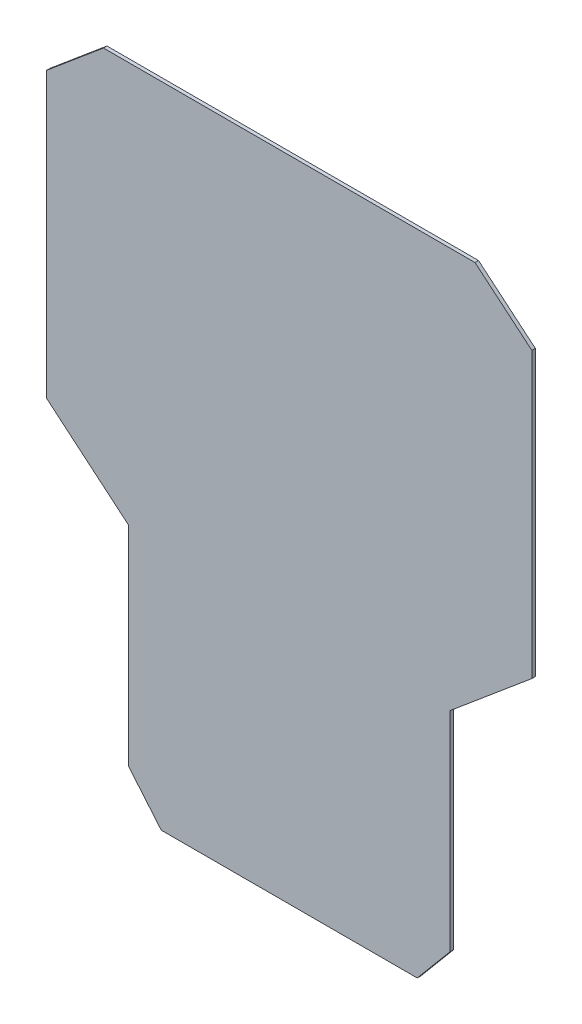
ISO-10303-21;
HEADER;
FILE_DESCRIPTION(('STEP AP214'),'2;1');
FILE_NAME('part.step','',(''),(''),'','','');
FILE_SCHEMA(('AUTOMOTIVE_DESIGN { 1 0 10303 214 1 1 1 1 }'));
ENDSEC;
DATA;
#1=APPLICATION_CONTEXT('core data for automotive mechanical design processes');
#2=APPLICATION_PROTOCOL_DEFINITION('international standard','automotive_design',2000,#1);
#3=PRODUCT_CONTEXT('',#1,'mechanical');
#4=PRODUCT('Part','Part','',(#3));
#5=PRODUCT_RELATED_PRODUCT_CATEGORY('part','',(#4));
#6=PRODUCT_DEFINITION_FORMATION('','',#4);
#7=PRODUCT_DEFINITION_CONTEXT('part definition',#1,'design');
#8=PRODUCT_DEFINITION('design','',#6,#7);
#9=PRODUCT_DEFINITION_SHAPE('','',#8);
#10=(LENGTH_UNIT() NAMED_UNIT(*) SI_UNIT(.MILLI.,.METRE.));
#11=(NAMED_UNIT(*) PLANE_ANGLE_UNIT() SI_UNIT($,.RADIAN.));
#12=(NAMED_UNIT(*) SI_UNIT($,.STERADIAN.) SOLID_ANGLE_UNIT());
#13=UNCERTAINTY_MEASURE_WITH_UNIT(LENGTH_MEASURE(1.E-05),#10,'distance_accuracy_value','');
#14=(GEOMETRIC_REPRESENTATION_CONTEXT(3) GLOBAL_UNCERTAINTY_ASSIGNED_CONTEXT((#13)) GLOBAL_UNIT_ASSIGNED_CONTEXT((#10,
#11,#12)) REPRESENTATION_CONTEXT('',''));
#15=CARTESIAN_POINT('',(0.,0.,0.));
#16=DIRECTION('',(0.,0.,1.));
#17=DIRECTION('',(1.,0.,0.));
#18=AXIS2_PLACEMENT_3D('',#15,#16,#17);
#19=CARTESIAN_POINT('',(69.,-50.8930332304934,1.5));
#20=DIRECTION('',(-1.,0.,0.));
#21=DIRECTION('',(0.,-1.,0.));
#22=AXIS2_PLACEMENT_3D('',#19,#20,#21);
#23=PLANE('',#22);
#24=DIRECTION('',(0.,1.,0.));
#25=VECTOR('',#24,1.);
#26=CARTESIAN_POINT('',(69.,-50.8930332304934,0.));
#27=LINE('',#26,#25);
#28=CARTESIAN_POINT('',(69.,-140.409741205043,0.));
#29=VERTEX_POINT('',#28);
#30=CARTESIAN_POINT('',(69.,-50.8930332304934,0.));
#31=VERTEX_POINT('',#30);
#32=EDGE_CURVE('E153',#29,#31,#27,.T.);
#33=ORIENTED_EDGE('',*,*,#32,.T.);
#34=DIRECTION('',(0.,0.,-1.));
#35=VECTOR('',#34,1.);
#36=CARTESIAN_POINT('',(69.,-50.8930332304934,1.5));
#37=LINE('',#36,#35);
#38=CARTESIAN_POINT('',(69.,-50.8930332304934,1.5));
#39=VERTEX_POINT('',#38);
#40=EDGE_CURVE('E11',#39,#31,#37,.T.);
#41=ORIENTED_EDGE('',*,*,#40,.F.);
#42=DIRECTION('',(0.,1.,0.));
#43=VECTOR('',#42,1.);
#44=CARTESIAN_POINT('',(69.,-50.8930332304934,1.5));
#45=LINE('',#44,#43);
#46=CARTESIAN_POINT('',(69.,-140.409741205043,1.5));
#47=VERTEX_POINT('',#46);
#48=EDGE_CURVE('E175',#47,#39,#45,.T.);
#49=ORIENTED_EDGE('',*,*,#48,.F.);
#50=DIRECTION('',(0.,0.,-1.));
#51=VECTOR('',#50,1.);
#52=CARTESIAN_POINT('',(69.,-140.409741205043,1.5));
#53=LINE('',#52,#51);
#54=EDGE_CURVE('E149',#47,#29,#53,.T.);
#55=ORIENTED_EDGE('',*,*,#54,.T.);
#56=EDGE_LOOP('',(#33,#41,#49,#55));
#57=FACE_BOUND('',#56,.T.);
#58=ADVANCED_FACE('F33',(#57),#23,.F.);
#59=CARTESIAN_POINT('',(104.,-21.5245461392886,1.5));
#60=DIRECTION('',(-0.642787609686538,0.766044443118979,0.));
#61=DIRECTION('',(-0.766044443118979,-0.642787609686538,0.));
#62=AXIS2_PLACEMENT_3D('',#59,#60,#61);
#63=PLANE('',#62);
#64=DIRECTION('',(0.766044443118979,0.642787609686538,0.));
#65=VECTOR('',#64,1.);
#66=CARTESIAN_POINT('',(104.,-21.5245461392886,0.));
#67=LINE('',#66,#65);
#68=CARTESIAN_POINT('',(104.,-21.5245461392886,0.));
#69=VERTEX_POINT('',#68);
#70=EDGE_CURVE('E156',#31,#69,#67,.T.);
#71=ORIENTED_EDGE('',*,*,#70,.T.);
#72=DIRECTION('',(0.,0.,-1.));
#73=VECTOR('',#72,1.);
#74=CARTESIAN_POINT('',(104.,-21.5245461392886,1.5));
#75=LINE('',#74,#73);
#76=CARTESIAN_POINT('',(104.,-21.5245461392886,1.5));
#77=VERTEX_POINT('',#76);
#78=EDGE_CURVE('E41',#77,#69,#75,.T.);
#79=ORIENTED_EDGE('',*,*,#78,.F.);
#80=DIRECTION('',(0.766044443118979,0.642787609686538,0.));
#81=VECTOR('',#80,1.);
#82=CARTESIAN_POINT('',(104.,-21.5245461392886,1.5));
#83=LINE('',#82,#81);
#84=EDGE_CURVE('E104',#39,#77,#83,.T.);
#85=ORIENTED_EDGE('',*,*,#84,.F.);
#86=ORIENTED_EDGE('',*,*,#40,.T.);
#87=EDGE_LOOP('',(#71,#79,#85,#86));
#88=FACE_BOUND('',#87,.T.);
#89=ADVANCED_FACE('F253',(#88),#63,.F.);
#90=CARTESIAN_POINT('',(104.,100.307715928557,1.5));
#91=DIRECTION('',(-1.,0.,0.));
#92=DIRECTION('',(0.,-1.,0.));
#93=AXIS2_PLACEMENT_3D('',#90,#91,#92);
#94=PLANE('',#93);
#95=DIRECTION('',(0.,1.,0.));
#96=VECTOR('',#95,1.);
#97=CARTESIAN_POINT('',(104.,100.307715928557,0.));
#98=LINE('',#97,#96);
#99=CARTESIAN_POINT('',(104.,100.307715928557,0.));
#100=VERTEX_POINT('',#99);
#101=EDGE_CURVE('E158',#69,#100,#98,.T.);
#102=ORIENTED_EDGE('',*,*,#101,.T.);
#103=DIRECTION('',(0.,0.,-1.));
#104=VECTOR('',#103,1.);
#105=CARTESIAN_POINT('',(104.,100.307715928557,1.5));
#106=LINE('',#105,#104);
#107=CARTESIAN_POINT('',(104.,100.307715928557,1.5));
#108=VERTEX_POINT('',#107);
#109=EDGE_CURVE('E194',#108,#100,#106,.T.);
#110=ORIENTED_EDGE('',*,*,#109,.F.);
#111=DIRECTION('',(0.,1.,0.));
#112=VECTOR('',#111,1.);
#113=CARTESIAN_POINT('',(104.,100.307715928557,1.5));
#114=LINE('',#113,#112);
#115=EDGE_CURVE('E202',#77,#108,#114,.T.);
#116=ORIENTED_EDGE('',*,*,#115,.F.);
#117=ORIENTED_EDGE('',*,*,#78,.T.);
#118=EDGE_LOOP('',(#102,#110,#116,#117));
#119=FACE_BOUND('',#118,.T.);
#120=ADVANCED_FACE('F200',(#119),#94,.F.);
#121=CARTESIAN_POINT('',(79.6360297657338,120.751514366145,1.5));
#122=DIRECTION('',(-0.642787609686543,-0.766044443118975,0.));
#123=DIRECTION('',(0.766044443118975,-0.642787609686543,0.));
#124=AXIS2_PLACEMENT_3D('',#121,#122,#123);
#125=PLANE('',#124);
#126=DIRECTION('',(-0.766044443118975,0.642787609686543,0.));
#127=VECTOR('',#126,1.);
#128=CARTESIAN_POINT('',(79.6360297657338,120.751514366145,0.));
#129=LINE('',#128,#127);
#130=CARTESIAN_POINT('',(79.6360297657338,120.751514366145,0.));
#131=VERTEX_POINT('',#130);
#132=EDGE_CURVE('E160',#100,#131,#129,.T.);
#133=ORIENTED_EDGE('',*,*,#132,.T.);
#134=DIRECTION('',(0.,0.,-1.));
#135=VECTOR('',#134,1.);
#136=CARTESIAN_POINT('',(79.6360297657338,120.751514366145,1.5));
#137=LINE('',#136,#135);
#138=CARTESIAN_POINT('',(79.6360297657338,120.751514366145,1.5));
#139=VERTEX_POINT('',#138);
#140=EDGE_CURVE('E191',#139,#131,#137,.T.);
#141=ORIENTED_EDGE('',*,*,#140,.F.);
#142=DIRECTION('',(-0.766044443118975,0.642787609686543,0.));
#143=VECTOR('',#142,1.);
#144=CARTESIAN_POINT('',(79.6360297657338,120.751514366145,1.5));
#145=LINE('',#144,#143);
#146=EDGE_CURVE('E220',#108,#139,#145,.T.);
#147=ORIENTED_EDGE('',*,*,#146,.F.);
#148=ORIENTED_EDGE('',*,*,#109,.T.);
#149=EDGE_LOOP('',(#133,#141,#147,#148));
#150=FACE_BOUND('',#149,.T.);
#151=ADVANCED_FACE('F211',(#150),#125,.F.);
#152=CARTESIAN_POINT('',(-79.6360297657337,120.751514366145,1.5));
#153=DIRECTION('',(0.,-1.,0.));
#154=DIRECTION('',(0.,0.,-1.));
#155=AXIS2_PLACEMENT_3D('',#152,#153,#154);
#156=PLANE('',#155);
#157=DIRECTION('',(-1.,0.,0.));
#158=VECTOR('',#157,1.);
#159=CARTESIAN_POINT('',(-79.6360297657337,120.751514366145,0.));
#160=LINE('',#159,#158);
#161=CARTESIAN_POINT('',(-79.6360297657337,120.751514366145,0.));
#162=VERTEX_POINT('',#161);
#163=EDGE_CURVE('E162',#131,#162,#160,.T.);
#164=ORIENTED_EDGE('',*,*,#163,.T.);
#165=DIRECTION('',(0.,0.,-1.));
#166=VECTOR('',#165,1.);
#167=CARTESIAN_POINT('',(-79.6360297657337,120.751514366145,1.5));
#168=LINE('',#167,#166);
#169=CARTESIAN_POINT('',(-79.6360297657337,120.751514366145,1.5));
#170=VERTEX_POINT('',#169);
#171=EDGE_CURVE('E188',#170,#162,#168,.T.);
#172=ORIENTED_EDGE('',*,*,#171,.F.);
#173=DIRECTION('',(-1.,0.,0.));
#174=VECTOR('',#173,1.);
#175=CARTESIAN_POINT('',(-79.6360297657337,120.751514366145,1.5));
#176=LINE('',#175,#174);
#177=EDGE_CURVE('E217',#139,#170,#176,.T.);
#178=ORIENTED_EDGE('',*,*,#177,.F.);
#179=ORIENTED_EDGE('',*,*,#140,.T.);
#180=EDGE_LOOP('',(#164,#172,#178,#179));
#181=FACE_BOUND('',#180,.T.);
#182=ADVANCED_FACE('F215',(#181),#156,.F.);
#183=CARTESIAN_POINT('',(-104.,100.307715928557,1.5));
#184=DIRECTION('',(0.642787609686542,-0.766044443118976,0.));
#185=DIRECTION('',(0.766044443118976,0.642787609686542,0.));
#186=AXIS2_PLACEMENT_3D('',#183,#184,#185);
#187=PLANE('',#186);
#188=DIRECTION('',(-0.766044443118976,-0.642787609686542,0.));
#189=VECTOR('',#188,1.);
#190=CARTESIAN_POINT('',(-104.,100.307715928557,0.));
#191=LINE('',#190,#189);
#192=CARTESIAN_POINT('',(-104.,100.307715928557,0.));
#193=VERTEX_POINT('',#192);
#194=EDGE_CURVE('E164',#162,#193,#191,.T.);
#195=ORIENTED_EDGE('',*,*,#194,.T.);
#196=DIRECTION('',(0.,0.,-1.));
#197=VECTOR('',#196,1.);
#198=CARTESIAN_POINT('',(-104.,100.307715928557,1.5));
#199=LINE('',#198,#197);
#200=CARTESIAN_POINT('',(-104.,100.307715928557,1.5));
#201=VERTEX_POINT('',#200);
#202=EDGE_CURVE('E185',#201,#193,#199,.T.);
#203=ORIENTED_EDGE('',*,*,#202,.F.);
#204=DIRECTION('',(-0.766044443118976,-0.642787609686542,0.));
#205=VECTOR('',#204,1.);
#206=CARTESIAN_POINT('',(-104.,100.307715928557,1.5));
#207=LINE('',#206,#205);
#208=EDGE_CURVE('E219',#170,#201,#207,.T.);
#209=ORIENTED_EDGE('',*,*,#208,.F.);
#210=ORIENTED_EDGE('',*,*,#171,.T.);
#211=EDGE_LOOP('',(#195,#203,#209,#210));
#212=FACE_BOUND('',#211,.T.);
#213=ADVANCED_FACE('F266',(#212),#187,.F.);
#214=CARTESIAN_POINT('',(-104.,100.307715928557,1.5));
#215=DIRECTION('',(1.,0.,0.));
#216=DIRECTION('',(0.,1.,0.));
#217=AXIS2_PLACEMENT_3D('',#214,#215,#216);
#218=PLANE('',#217);
#219=DIRECTION('',(0.,-1.,0.));
#220=VECTOR('',#219,1.);
#221=CARTESIAN_POINT('',(-104.,100.307715928557,0.));
#222=LINE('',#221,#220);
#223=CARTESIAN_POINT('',(-104.,-21.5245461392886,0.));
#224=VERTEX_POINT('',#223);
#225=EDGE_CURVE('E166',#193,#224,#222,.T.);
#226=ORIENTED_EDGE('',*,*,#225,.T.);
#227=DIRECTION('',(0.,0.,-1.));
#228=VECTOR('',#227,1.);
#229=CARTESIAN_POINT('',(-104.,-21.5245461392886,1.5));
#230=LINE('',#229,#228);
#231=CARTESIAN_POINT('',(-104.,-21.5245461392886,1.5));
#232=VERTEX_POINT('',#231);
#233=EDGE_CURVE('E182',#232,#224,#230,.T.);
#234=ORIENTED_EDGE('',*,*,#233,.F.);
#235=DIRECTION('',(0.,-1.,0.));
#236=VECTOR('',#235,1.);
#237=CARTESIAN_POINT('',(-104.,100.307715928557,1.5));
#238=LINE('',#237,#236);
#239=EDGE_CURVE('E222',#201,#232,#238,.T.);
#240=ORIENTED_EDGE('',*,*,#239,.F.);
#241=ORIENTED_EDGE('',*,*,#202,.T.);
#242=EDGE_LOOP('',(#226,#234,#240,#241));
#243=FACE_BOUND('',#242,.T.);
#244=ADVANCED_FACE('F269',(#243),#218,.F.);
#245=CARTESIAN_POINT('',(-104.,-21.5245461392886,1.5));
#246=DIRECTION('',(0.642787609686538,0.766044443118979,0.));
#247=DIRECTION('',(-0.766044443118979,0.642787609686538,0.));
#248=AXIS2_PLACEMENT_3D('',#245,#246,#247);
#249=PLANE('',#248);
#250=DIRECTION('',(0.766044443118979,-0.642787609686538,0.));
#251=VECTOR('',#250,1.);
#252=CARTESIAN_POINT('',(-104.,-21.5245461392886,0.));
#253=LINE('',#252,#251);
#254=CARTESIAN_POINT('',(-69.,-50.8930332304934,0.));
#255=VERTEX_POINT('',#254);
#256=EDGE_CURVE('E168',#224,#255,#253,.T.);
#257=ORIENTED_EDGE('',*,*,#256,.T.);
#258=DIRECTION('',(0.,0.,-1.));
#259=VECTOR('',#258,1.);
#260=CARTESIAN_POINT('',(-69.,-50.8930332304934,1.5));
#261=LINE('',#260,#259);
#262=CARTESIAN_POINT('',(-69.,-50.8930332304934,1.5));
#263=VERTEX_POINT('',#262);
#264=EDGE_CURVE('E179',#263,#255,#261,.T.);
#265=ORIENTED_EDGE('',*,*,#264,.F.);
#266=DIRECTION('',(0.766044443118979,-0.642787609686538,0.));
#267=VECTOR('',#266,1.);
#268=CARTESIAN_POINT('',(-104.,-21.5245461392886,1.5));
#269=LINE('',#268,#267);
#270=EDGE_CURVE('E228',#232,#263,#269,.T.);
#271=ORIENTED_EDGE('',*,*,#270,.F.);
#272=ORIENTED_EDGE('',*,*,#233,.T.);
#273=EDGE_LOOP('',(#257,#265,#271,#272));
#274=FACE_BOUND('',#273,.T.);
#275=ADVANCED_FACE('F234',(#274),#249,.F.);
#276=CARTESIAN_POINT('',(-69.,-50.8930332304934,1.5));
#277=DIRECTION('',(1.,0.,0.));
#278=DIRECTION('',(0.,1.,0.));
#279=AXIS2_PLACEMENT_3D('',#276,#277,#278);
#280=PLANE('',#279);
#281=DIRECTION('',(0.,-1.,0.));
#282=VECTOR('',#281,1.);
#283=CARTESIAN_POINT('',(-69.,-50.8930332304934,0.));
#284=LINE('',#283,#282);
#285=CARTESIAN_POINT('',(-69.,-140.409741205043,0.));
#286=VERTEX_POINT('',#285);
#287=EDGE_CURVE('E170',#255,#286,#284,.T.);
#288=ORIENTED_EDGE('',*,*,#287,.T.);
#289=DIRECTION('',(0.,0.,-1.));
#290=VECTOR('',#289,1.);
#291=CARTESIAN_POINT('',(-69.,-140.409741205043,1.5));
#292=LINE('',#291,#290);
#293=CARTESIAN_POINT('',(-69.,-140.409741205043,1.5));
#294=VERTEX_POINT('',#293);
#295=EDGE_CURVE('E144',#294,#286,#292,.T.);
#296=ORIENTED_EDGE('',*,*,#295,.F.);
#297=DIRECTION('',(0.,-1.,0.));
#298=VECTOR('',#297,1.);
#299=CARTESIAN_POINT('',(-69.,-50.8930332304934,1.5));
#300=LINE('',#299,#298);
#301=EDGE_CURVE('E135',#263,#294,#300,.T.);
#302=ORIENTED_EDGE('',*,*,#301,.F.);
#303=ORIENTED_EDGE('',*,*,#264,.T.);
#304=EDGE_LOOP('',(#288,#296,#302,#303));
#305=FACE_BOUND('',#304,.T.);
#306=ADVANCED_FACE('F238',(#305),#280,.F.);
#307=CARTESIAN_POINT('',(-69.,-140.409741205043,1.5));
#308=DIRECTION('',(0.766044443118979,0.642787609686539,0.));
#309=DIRECTION('',(-0.642787609686539,0.766044443118979,0.));
#310=AXIS2_PLACEMENT_3D('',#307,#308,#309);
#311=PLANE('',#310);
#312=DIRECTION('',(0.642787609686539,-0.766044443118979,0.));
#313=VECTOR('',#312,1.);
#314=CARTESIAN_POINT('',(-69.,-140.409741205043,0.));
#315=LINE('',#314,#313);
#316=CARTESIAN_POINT('',(-54.8706157602949,-157.248485633855,0.));
#317=VERTEX_POINT('',#316);
#318=EDGE_CURVE('E143',#286,#317,#315,.T.);
#319=ORIENTED_EDGE('',*,*,#318,.T.);
#320=DIRECTION('',(0.,0.,-1.));
#321=VECTOR('',#320,1.);
#322=CARTESIAN_POINT('',(-54.8706157602949,-157.248485633855,1.5));
#323=LINE('',#322,#321);
#324=CARTESIAN_POINT('',(-54.8706157602949,-157.248485633855,1.5));
#325=VERTEX_POINT('',#324);
#326=EDGE_CURVE('E140',#325,#317,#323,.T.);
#327=ORIENTED_EDGE('',*,*,#326,.F.);
#328=DIRECTION('',(0.642787609686539,-0.766044443118979,0.));
#329=VECTOR('',#328,1.);
#330=CARTESIAN_POINT('',(-69.,-140.409741205043,1.5));
#331=LINE('',#330,#329);
#332=EDGE_CURVE('E129',#294,#325,#331,.T.);
#333=ORIENTED_EDGE('',*,*,#332,.F.);
#334=ORIENTED_EDGE('',*,*,#295,.T.);
#335=EDGE_LOOP('',(#319,#327,#333,#334));
#336=FACE_BOUND('',#335,.T.);
#337=ADVANCED_FACE('F141',(#336),#311,.F.);
#338=CARTESIAN_POINT('',(-54.8706157602949,-157.248485633855,1.5));
#339=DIRECTION('',(0.,1.,0.));
#340=DIRECTION('',(0.,0.,1.));
#341=AXIS2_PLACEMENT_3D('',#338,#339,#340);
#342=PLANE('',#341);
#343=DIRECTION('',(1.,0.,0.));
#344=VECTOR('',#343,1.);
#345=CARTESIAN_POINT('',(-54.8706157602949,-157.248485633855,0.));
#346=LINE('',#345,#344);
#347=CARTESIAN_POINT('',(54.870615760295,-157.248485633855,0.));
#348=VERTEX_POINT('',#347);
#349=EDGE_CURVE('E90',#317,#348,#346,.T.);
#350=ORIENTED_EDGE('',*,*,#349,.T.);
#351=DIRECTION('',(0.,0.,-1.));
#352=VECTOR('',#351,1.);
#353=CARTESIAN_POINT('',(54.870615760295,-157.248485633855,1.5));
#354=LINE('',#353,#352);
#355=CARTESIAN_POINT('',(54.870615760295,-157.248485633855,1.5));
#356=VERTEX_POINT('',#355);
#357=EDGE_CURVE('E145',#356,#348,#354,.T.);
#358=ORIENTED_EDGE('',*,*,#357,.F.);
#359=DIRECTION('',(1.,0.,0.));
#360=VECTOR('',#359,1.);
#361=CARTESIAN_POINT('',(-54.8706157602949,-157.248485633855,1.5));
#362=LINE('',#361,#360);
#363=EDGE_CURVE('E133',#325,#356,#362,.T.);
#364=ORIENTED_EDGE('',*,*,#363,.F.);
#365=ORIENTED_EDGE('',*,*,#326,.T.);
#366=EDGE_LOOP('',(#350,#358,#364,#365));
#367=FACE_BOUND('',#366,.T.);
#368=ADVANCED_FACE('F147',(#367),#342,.F.);
#369=CARTESIAN_POINT('',(54.870615760295,-157.248485633855,1.5));
#370=DIRECTION('',(-0.766044443118979,0.642787609686538,0.));
#371=DIRECTION('',(-0.642787609686538,-0.766044443118979,0.));
#372=AXIS2_PLACEMENT_3D('',#369,#370,#371);
#373=PLANE('',#372);
#374=DIRECTION('',(0.642787609686538,0.76604444311898,0.));
#375=VECTOR('',#374,1.);
#376=CARTESIAN_POINT('',(54.870615760295,-157.248485633855,0.));
#377=LINE('',#376,#375);
#378=EDGE_CURVE('E96',#348,#29,#377,.T.);
#379=ORIENTED_EDGE('',*,*,#378,.T.);
#380=ORIENTED_EDGE('',*,*,#54,.F.);
#381=DIRECTION('',(0.642787609686538,0.76604444311898,0.));
#382=VECTOR('',#381,1.);
#383=CARTESIAN_POINT('',(54.870615760295,-157.248485633855,1.5));
#384=LINE('',#383,#382);
#385=EDGE_CURVE('E49',#356,#47,#384,.T.);
#386=ORIENTED_EDGE('',*,*,#385,.F.);
#387=ORIENTED_EDGE('',*,*,#357,.T.);
#388=EDGE_LOOP('',(#379,#380,#386,#387));
#389=FACE_BOUND('',#388,.T.);
#390=ADVANCED_FACE('F242',(#389),#373,.F.);
#391=CARTESIAN_POINT('',(0.,0.,1.5));
#392=DIRECTION('',(0.,0.,1.));
#393=DIRECTION('',(1.,0.,0.));
#394=AXIS2_PLACEMENT_3D('',#391,#392,#393);
#395=PLANE('',#394);
#396=ORIENTED_EDGE('',*,*,#48,.T.);
#397=ORIENTED_EDGE('',*,*,#84,.T.);
#398=ORIENTED_EDGE('',*,*,#115,.T.);
#399=ORIENTED_EDGE('',*,*,#146,.T.);
#400=ORIENTED_EDGE('',*,*,#177,.T.);
#401=ORIENTED_EDGE('',*,*,#208,.T.);
#402=ORIENTED_EDGE('',*,*,#239,.T.);
#403=ORIENTED_EDGE('',*,*,#270,.T.);
#404=ORIENTED_EDGE('',*,*,#301,.T.);
#405=ORIENTED_EDGE('',*,*,#332,.T.);
#406=ORIENTED_EDGE('',*,*,#363,.T.);
#407=ORIENTED_EDGE('',*,*,#385,.T.);
#408=EDGE_LOOP('',(#396,#397,#398,#399,#400,#401,#402,#403,#404,#405,#406,#407));
#409=FACE_BOUND('',#408,.T.);
#410=ADVANCED_FACE('F131',(#409),#395,.T.);
#411=CARTESIAN_POINT('',(0.,0.,0.));
#412=DIRECTION('',(0.,0.,1.));
#413=DIRECTION('',(1.,0.,0.));
#414=AXIS2_PLACEMENT_3D('',#411,#412,#413);
#415=PLANE('',#414);
#416=ORIENTED_EDGE('',*,*,#32,.F.);
#417=ORIENTED_EDGE('',*,*,#378,.F.);
#418=ORIENTED_EDGE('',*,*,#349,.F.);
#419=ORIENTED_EDGE('',*,*,#318,.F.);
#420=ORIENTED_EDGE('',*,*,#287,.F.);
#421=ORIENTED_EDGE('',*,*,#256,.F.);
#422=ORIENTED_EDGE('',*,*,#225,.F.);
#423=ORIENTED_EDGE('',*,*,#194,.F.);
#424=ORIENTED_EDGE('',*,*,#163,.F.);
#425=ORIENTED_EDGE('',*,*,#132,.F.);
#426=ORIENTED_EDGE('',*,*,#101,.F.);
#427=ORIENTED_EDGE('',*,*,#70,.F.);
#428=EDGE_LOOP('',(#416,#417,#418,#419,#420,#421,#422,#423,#424,#425,#426,#427));
#429=FACE_BOUND('',#428,.T.);
#430=ADVANCED_FACE('F206',(#429),#415,.F.);
#431=CLOSED_SHELL('',(#58,#89,#120,#151,#182,#213,#244,#275,#306,#337,#368,#390,#410,#430));
#432=MANIFOLD_SOLID_BREP('B2',#431);
#433=ADVANCED_BREP_SHAPE_REPRESENTATION('',(#18,#432),#14);
#434=SHAPE_DEFINITION_REPRESENTATION(#9,#433);
ENDSEC;
END-ISO-10303-21;
